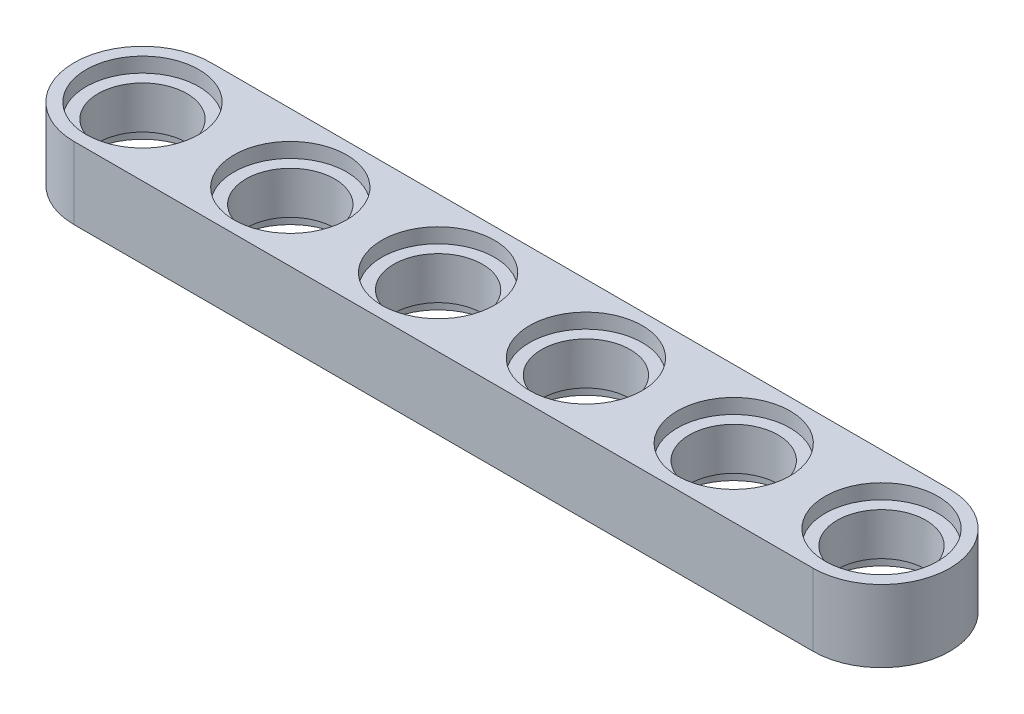
ISO-10303-21;
HEADER;
FILE_DESCRIPTION(('STEP AP214'),'2;1');
FILE_NAME('part.step','',(''),(''),'','','');
FILE_SCHEMA(('AUTOMOTIVE_DESIGN { 1 0 10303 214 1 1 1 1 }'));
ENDSEC;
DATA;
#1=APPLICATION_CONTEXT('core data for automotive mechanical design processes');
#2=APPLICATION_PROTOCOL_DEFINITION('international standard','automotive_design',2000,#1);
#3=PRODUCT_CONTEXT('',#1,'mechanical');
#4=PRODUCT('Part','Part','',(#3));
#5=PRODUCT_RELATED_PRODUCT_CATEGORY('part','',(#4));
#6=PRODUCT_DEFINITION_FORMATION('','',#4);
#7=PRODUCT_DEFINITION_CONTEXT('part definition',#1,'design');
#8=PRODUCT_DEFINITION('design','',#6,#7);
#9=PRODUCT_DEFINITION_SHAPE('','',#8);
#10=(LENGTH_UNIT() NAMED_UNIT(*) SI_UNIT(.MILLI.,.METRE.));
#11=(NAMED_UNIT(*) PLANE_ANGLE_UNIT() SI_UNIT($,.RADIAN.));
#12=(NAMED_UNIT(*) SI_UNIT($,.STERADIAN.) SOLID_ANGLE_UNIT());
#13=UNCERTAINTY_MEASURE_WITH_UNIT(LENGTH_MEASURE(1.E-05),#10,'distance_accuracy_value','');
#14=(GEOMETRIC_REPRESENTATION_CONTEXT(3) GLOBAL_UNCERTAINTY_ASSIGNED_CONTEXT((#13)) GLOBAL_UNIT_ASSIGNED_CONTEXT((#10,
#11,#12)) REPRESENTATION_CONTEXT('',''));
#15=CARTESIAN_POINT('',(0.,0.,0.));
#16=DIRECTION('',(0.,0.,1.));
#17=DIRECTION('',(1.,0.,0.));
#18=AXIS2_PLACEMENT_3D('',#15,#16,#17);
#19=CARTESIAN_POINT('',(0.,-3.9,0.));
#20=DIRECTION('',(0.,1.,0.));
#21=DIRECTION('',(0.,0.,1.));
#22=AXIS2_PLACEMENT_3D('',#19,#20,#21);
#23=CYLINDRICAL_SURFACE('',#22,2.4);
#24=CARTESIAN_POINT('',(0.,3.1,0.));
#25=DIRECTION('',(0.,1.,0.));
#26=DIRECTION('',(0.,0.,1.));
#27=AXIS2_PLACEMENT_3D('',#24,#25,#26);
#28=CIRCLE('',#27,2.4);
#29=CARTESIAN_POINT('',(0.,3.1,2.4));
#30=VERTEX_POINT('',#29);
#31=EDGE_CURVE('E109',#30,#30,#28,.F.);
#32=ORIENTED_EDGE('',*,*,#31,.F.);
#33=EDGE_LOOP('',(#32));
#34=FACE_BOUND('',#33,.T.);
#35=CARTESIAN_POINT('',(0.,0.8,0.));
#36=DIRECTION('',(0.,-1.,0.));
#37=DIRECTION('',(0.,0.,-1.));
#38=AXIS2_PLACEMENT_3D('',#35,#36,#37);
#39=CIRCLE('',#38,2.4);
#40=CARTESIAN_POINT('',(0.,0.8,-2.4));
#41=VERTEX_POINT('',#40);
#42=EDGE_CURVE('E40',#41,#41,#39,.F.);
#43=ORIENTED_EDGE('',*,*,#42,.F.);
#44=EDGE_LOOP('',(#43));
#45=FACE_BOUND('',#44,.T.);
#46=ADVANCED_FACE('F36',(#34,#45),#23,.F.);
#47=CARTESIAN_POINT('',(8.,-3.9,0.));
#48=DIRECTION('',(0.,1.,0.));
#49=DIRECTION('',(0.,0.,1.));
#50=AXIS2_PLACEMENT_3D('',#47,#48,#49);
#51=CYLINDRICAL_SURFACE('',#50,2.4);
#52=CARTESIAN_POINT('',(8.,3.1,0.));
#53=DIRECTION('',(0.,1.,0.));
#54=DIRECTION('',(0.,0.,1.));
#55=AXIS2_PLACEMENT_3D('',#52,#53,#54);
#56=CIRCLE('',#55,2.4);
#57=CARTESIAN_POINT('',(8.,3.1,2.4));
#58=VERTEX_POINT('',#57);
#59=EDGE_CURVE('E125',#58,#58,#56,.F.);
#60=ORIENTED_EDGE('',*,*,#59,.F.);
#61=EDGE_LOOP('',(#60));
#62=FACE_BOUND('',#61,.T.);
#63=CARTESIAN_POINT('',(8.,0.8,0.));
#64=DIRECTION('',(0.,-1.,0.));
#65=DIRECTION('',(0.,0.,-1.));
#66=AXIS2_PLACEMENT_3D('',#63,#64,#65);
#67=CIRCLE('',#66,2.4);
#68=CARTESIAN_POINT('',(8.,0.8,-2.4));
#69=VERTEX_POINT('',#68);
#70=EDGE_CURVE('E145',#69,#69,#67,.F.);
#71=ORIENTED_EDGE('',*,*,#70,.F.);
#72=EDGE_LOOP('',(#71));
#73=FACE_BOUND('',#72,.T.);
#74=ADVANCED_FACE('F227',(#62,#73),#51,.F.);
#75=CARTESIAN_POINT('',(-16.,-3.9,0.));
#76=DIRECTION('',(0.,1.,0.));
#77=DIRECTION('',(0.,0.,1.));
#78=AXIS2_PLACEMENT_3D('',#75,#76,#77);
#79=CYLINDRICAL_SURFACE('',#78,2.4);
#80=CARTESIAN_POINT('',(-16.,3.1,0.));
#81=DIRECTION('',(0.,1.,0.));
#82=DIRECTION('',(0.,0.,1.));
#83=AXIS2_PLACEMENT_3D('',#80,#81,#82);
#84=CIRCLE('',#83,2.4);
#85=CARTESIAN_POINT('',(-16.,3.1,2.4));
#86=VERTEX_POINT('',#85);
#87=EDGE_CURVE('E118',#86,#86,#84,.F.);
#88=ORIENTED_EDGE('',*,*,#87,.F.);
#89=EDGE_LOOP('',(#88));
#90=FACE_BOUND('',#89,.T.);
#91=CARTESIAN_POINT('',(-16.,0.8,0.));
#92=DIRECTION('',(0.,-1.,0.));
#93=DIRECTION('',(0.,0.,-1.));
#94=AXIS2_PLACEMENT_3D('',#91,#92,#93);
#95=CIRCLE('',#94,2.4);
#96=CARTESIAN_POINT('',(-16.,0.8,-2.4));
#97=VERTEX_POINT('',#96);
#98=EDGE_CURVE('E143',#97,#97,#95,.F.);
#99=ORIENTED_EDGE('',*,*,#98,.F.);
#100=EDGE_LOOP('',(#99));
#101=FACE_BOUND('',#100,.T.);
#102=ADVANCED_FACE('F233',(#90,#101),#79,.F.);
#103=CARTESIAN_POINT('',(24.,-3.9,0.));
#104=DIRECTION('',(0.,1.,0.));
#105=DIRECTION('',(0.,0.,1.));
#106=AXIS2_PLACEMENT_3D('',#103,#104,#105);
#107=CYLINDRICAL_SURFACE('',#106,2.4);
#108=CARTESIAN_POINT('',(24.,3.1,0.));
#109=DIRECTION('',(0.,1.,0.));
#110=DIRECTION('',(0.,0.,1.));
#111=AXIS2_PLACEMENT_3D('',#108,#109,#110);
#112=CIRCLE('',#111,2.4);
#113=CARTESIAN_POINT('',(24.,3.1,2.4));
#114=VERTEX_POINT('',#113);
#115=EDGE_CURVE('E115',#114,#114,#112,.F.);
#116=ORIENTED_EDGE('',*,*,#115,.F.);
#117=EDGE_LOOP('',(#116));
#118=FACE_BOUND('',#117,.T.);
#119=CARTESIAN_POINT('',(24.,0.8,0.));
#120=DIRECTION('',(0.,-1.,0.));
#121=DIRECTION('',(0.,0.,-1.));
#122=AXIS2_PLACEMENT_3D('',#119,#120,#121);
#123=CIRCLE('',#122,2.4);
#124=CARTESIAN_POINT('',(24.,0.8,-2.4));
#125=VERTEX_POINT('',#124);
#126=EDGE_CURVE('E140',#125,#125,#123,.F.);
#127=ORIENTED_EDGE('',*,*,#126,.F.);
#128=EDGE_LOOP('',(#127));
#129=FACE_BOUND('',#128,.T.);
#130=ADVANCED_FACE('F383',(#118,#129),#107,.F.);
#131=CARTESIAN_POINT('',(-16.,3.9,-3.7));
#132=DIRECTION('',(0.,0.,-1.));
#133=DIRECTION('',(-1.,0.,0.));
#134=AXIS2_PLACEMENT_3D('',#131,#132,#133);
#135=PLANE('',#134);
#136=DIRECTION('',(1.,0.,0.));
#137=VECTOR('',#136,1.);
#138=CARTESIAN_POINT('',(-16.,0.,-3.7));
#139=LINE('',#138,#137);
#140=CARTESIAN_POINT('',(-16.,0.,-3.7));
#141=VERTEX_POINT('',#140);
#142=CARTESIAN_POINT('',(24.,0.,-3.7));
#143=VERTEX_POINT('',#142);
#144=EDGE_CURVE('E105',#141,#143,#139,.T.);
#145=ORIENTED_EDGE('',*,*,#144,.F.);
#146=DIRECTION('',(0.,-1.,0.));
#147=VECTOR('',#146,1.);
#148=CARTESIAN_POINT('',(-16.,3.9,-3.7));
#149=LINE('',#148,#147);
#150=CARTESIAN_POINT('',(-16.,3.9,-3.7));
#151=VERTEX_POINT('',#150);
#152=EDGE_CURVE('E11',#151,#141,#149,.T.);
#153=ORIENTED_EDGE('',*,*,#152,.F.);
#154=DIRECTION('',(1.,0.,0.));
#155=VECTOR('',#154,1.);
#156=CARTESIAN_POINT('',(-16.,3.9,-3.7));
#157=LINE('',#156,#155);
#158=CARTESIAN_POINT('',(24.,3.9,-3.7));
#159=VERTEX_POINT('',#158);
#160=EDGE_CURVE('E99',#151,#159,#157,.T.);
#161=ORIENTED_EDGE('',*,*,#160,.T.);
#162=DIRECTION('',(0.,-1.,0.));
#163=VECTOR('',#162,1.);
#164=CARTESIAN_POINT('',(24.,3.9,-3.7));
#165=LINE('',#164,#163);
#166=EDGE_CURVE('E78',#159,#143,#165,.T.);
#167=ORIENTED_EDGE('',*,*,#166,.T.);
#168=EDGE_LOOP('',(#145,#153,#161,#167));
#169=FACE_BOUND('',#168,.T.);
#170=ADVANCED_FACE('F38',(#169),#135,.T.);
#171=CARTESIAN_POINT('',(-16.,3.9,0.));
#172=DIRECTION('',(0.,-1.,0.));
#173=DIRECTION('',(0.,0.,-1.));
#174=AXIS2_PLACEMENT_3D('',#171,#172,#173);
#175=CYLINDRICAL_SURFACE('',#174,3.7);
#176=CARTESIAN_POINT('',(-16.,0.,0.));
#177=DIRECTION('',(0.,1.,0.));
#178=DIRECTION('',(0.,0.,1.));
#179=AXIS2_PLACEMENT_3D('',#176,#177,#178);
#180=CIRCLE('',#179,3.7);
#181=CARTESIAN_POINT('',(-16.,0.,3.7));
#182=VERTEX_POINT('',#181);
#183=EDGE_CURVE('E70',#141,#182,#180,.T.);
#184=ORIENTED_EDGE('',*,*,#183,.T.);
#185=DIRECTION('',(0.,-1.,0.));
#186=VECTOR('',#185,1.);
#187=CARTESIAN_POINT('',(-16.,3.9,3.7));
#188=LINE('',#187,#186);
#189=CARTESIAN_POINT('',(-16.,3.9,3.7));
#190=VERTEX_POINT('',#189);
#191=EDGE_CURVE('E46',#190,#182,#188,.T.);
#192=ORIENTED_EDGE('',*,*,#191,.F.);
#193=CARTESIAN_POINT('',(-16.,3.9,0.));
#194=DIRECTION('',(0.,1.,0.));
#195=DIRECTION('',(0.,0.,1.));
#196=AXIS2_PLACEMENT_3D('',#193,#194,#195);
#197=CIRCLE('',#196,3.7);
#198=EDGE_CURVE('E88',#151,#190,#197,.T.);
#199=ORIENTED_EDGE('',*,*,#198,.F.);
#200=ORIENTED_EDGE('',*,*,#152,.T.);
#201=EDGE_LOOP('',(#184,#192,#199,#200));
#202=FACE_BOUND('',#201,.T.);
#203=ADVANCED_FACE('F245',(#202),#175,.T.);
#204=CARTESIAN_POINT('',(-16.,3.9,3.7));
#205=DIRECTION('',(0.,0.,-1.));
#206=DIRECTION('',(-1.,0.,0.));
#207=AXIS2_PLACEMENT_3D('',#204,#205,#206);
#208=PLANE('',#207);
#209=DIRECTION('',(1.,0.,0.));
#210=VECTOR('',#209,1.);
#211=CARTESIAN_POINT('',(-16.,0.,3.7));
#212=LINE('',#211,#210);
#213=CARTESIAN_POINT('',(24.,0.,3.7));
#214=VERTEX_POINT('',#213);
#215=EDGE_CURVE('E95',#182,#214,#212,.T.);
#216=ORIENTED_EDGE('',*,*,#215,.T.);
#217=DIRECTION('',(0.,-1.,0.));
#218=VECTOR('',#217,1.);
#219=CARTESIAN_POINT('',(24.,3.9,3.7));
#220=LINE('',#219,#218);
#221=CARTESIAN_POINT('',(24.,3.9,3.7));
#222=VERTEX_POINT('',#221);
#223=EDGE_CURVE('E92',#222,#214,#220,.T.);
#224=ORIENTED_EDGE('',*,*,#223,.F.);
#225=DIRECTION('',(1.,0.,0.));
#226=VECTOR('',#225,1.);
#227=CARTESIAN_POINT('',(-16.,3.9,3.7));
#228=LINE('',#227,#226);
#229=EDGE_CURVE('E83',#190,#222,#228,.T.);
#230=ORIENTED_EDGE('',*,*,#229,.F.);
#231=ORIENTED_EDGE('',*,*,#191,.T.);
#232=EDGE_LOOP('',(#216,#224,#230,#231));
#233=FACE_BOUND('',#232,.T.);
#234=ADVANCED_FACE('F93',(#233),#208,.F.);
#235=CARTESIAN_POINT('',(24.,3.9,0.));
#236=DIRECTION('',(0.,-1.,0.));
#237=DIRECTION('',(0.,0.,-1.));
#238=AXIS2_PLACEMENT_3D('',#235,#236,#237);
#239=CYLINDRICAL_SURFACE('',#238,3.7);
#240=CARTESIAN_POINT('',(24.,0.,0.));
#241=DIRECTION('',(0.,-1.,0.));
#242=DIRECTION('',(0.,0.,-1.));
#243=AXIS2_PLACEMENT_3D('',#240,#241,#242);
#244=CIRCLE('',#243,3.7);
#245=EDGE_CURVE('E108',#143,#214,#244,.T.);
#246=ORIENTED_EDGE('',*,*,#245,.F.);
#247=ORIENTED_EDGE('',*,*,#166,.F.);
#248=CARTESIAN_POINT('',(24.,3.9,0.));
#249=DIRECTION('',(0.,-1.,0.));
#250=DIRECTION('',(0.,0.,-1.));
#251=AXIS2_PLACEMENT_3D('',#248,#249,#250);
#252=CIRCLE('',#251,3.7);
#253=EDGE_CURVE('E87',#159,#222,#252,.T.);
#254=ORIENTED_EDGE('',*,*,#253,.T.);
#255=ORIENTED_EDGE('',*,*,#223,.T.);
#256=EDGE_LOOP('',(#246,#247,#254,#255));
#257=FACE_BOUND('',#256,.T.);
#258=ADVANCED_FACE('F98',(#257),#239,.T.);
#259=CARTESIAN_POINT('',(24.,3.9,0.));
#260=DIRECTION('',(0.,-1.,0.));
#261=DIRECTION('',(0.,0.,-1.));
#262=AXIS2_PLACEMENT_3D('',#259,#260,#261);
#263=PLANE('',#262);
#264=CARTESIAN_POINT('',(24.,3.9,0.));
#265=DIRECTION('',(0.,1.,0.));
#266=DIRECTION('',(0.,0.,1.));
#267=AXIS2_PLACEMENT_3D('',#264,#265,#266);
#268=CIRCLE('',#267,3.05);
#269=CARTESIAN_POINT('',(24.,3.9,3.05));
#270=VERTEX_POINT('',#269);
#271=EDGE_CURVE('E150',#270,#270,#268,.T.);
#272=ORIENTED_EDGE('',*,*,#271,.F.);
#273=EDGE_LOOP('',(#272));
#274=FACE_BOUND('',#273,.T.);
#275=CARTESIAN_POINT('',(-8.,3.9,0.));
#276=DIRECTION('',(0.,1.,0.));
#277=DIRECTION('',(0.,0.,-1.));
#278=AXIS2_PLACEMENT_3D('',#275,#276,#277);
#279=CIRCLE('',#278,3.05);
#280=CARTESIAN_POINT('',(-8.,3.9,-3.05));
#281=VERTEX_POINT('',#280);
#282=EDGE_CURVE('E159',#281,#281,#279,.T.);
#283=ORIENTED_EDGE('',*,*,#282,.F.);
#284=EDGE_LOOP('',(#283));
#285=FACE_BOUND('',#284,.T.);
#286=CARTESIAN_POINT('',(-16.,3.9,0.));
#287=DIRECTION('',(0.,1.,0.));
#288=DIRECTION('',(0.,0.,1.));
#289=AXIS2_PLACEMENT_3D('',#286,#287,#288);
#290=CIRCLE('',#289,3.05);
#291=CARTESIAN_POINT('',(-16.,3.9,3.05));
#292=VERTEX_POINT('',#291);
#293=EDGE_CURVE('E189',#292,#292,#290,.T.);
#294=ORIENTED_EDGE('',*,*,#293,.F.);
#295=EDGE_LOOP('',(#294));
#296=FACE_BOUND('',#295,.T.);
#297=CARTESIAN_POINT('',(16.,3.9,0.));
#298=DIRECTION('',(0.,1.,0.));
#299=DIRECTION('',(0.,0.,-1.));
#300=AXIS2_PLACEMENT_3D('',#297,#298,#299);
#301=CIRCLE('',#300,3.05);
#302=CARTESIAN_POINT('',(16.,3.9,-3.05));
#303=VERTEX_POINT('',#302);
#304=EDGE_CURVE('E183',#303,#303,#301,.T.);
#305=ORIENTED_EDGE('',*,*,#304,.F.);
#306=EDGE_LOOP('',(#305));
#307=FACE_BOUND('',#306,.T.);
#308=CARTESIAN_POINT('',(0.,3.9,0.));
#309=DIRECTION('',(0.,1.,0.));
#310=DIRECTION('',(0.,0.,1.));
#311=AXIS2_PLACEMENT_3D('',#308,#309,#310);
#312=CIRCLE('',#311,3.05);
#313=CARTESIAN_POINT('',(0.,3.9,3.05));
#314=VERTEX_POINT('',#313);
#315=EDGE_CURVE('E170',#314,#314,#312,.T.);
#316=ORIENTED_EDGE('',*,*,#315,.F.);
#317=EDGE_LOOP('',(#316));
#318=FACE_BOUND('',#317,.T.);
#319=CARTESIAN_POINT('',(8.,3.9,0.));
#320=DIRECTION('',(0.,1.,0.));
#321=DIRECTION('',(0.,0.,1.));
#322=AXIS2_PLACEMENT_3D('',#319,#320,#321);
#323=CIRCLE('',#322,3.05);
#324=CARTESIAN_POINT('',(8.,3.9,3.05));
#325=VERTEX_POINT('',#324);
#326=EDGE_CURVE('E164',#325,#325,#323,.T.);
#327=ORIENTED_EDGE('',*,*,#326,.F.);
#328=EDGE_LOOP('',(#327));
#329=FACE_BOUND('',#328,.T.);
#330=ORIENTED_EDGE('',*,*,#160,.F.);
#331=ORIENTED_EDGE('',*,*,#198,.T.);
#332=ORIENTED_EDGE('',*,*,#229,.T.);
#333=ORIENTED_EDGE('',*,*,#253,.F.);
#334=EDGE_LOOP('',(#330,#331,#332,#333));
#335=FACE_BOUND('',#334,.T.);
#336=ADVANCED_FACE('F86',(#274,#285,#296,#307,#318,#329,#335),#263,.F.);
#337=CARTESIAN_POINT('',(24.,0.,0.));
#338=DIRECTION('',(0.,-1.,0.));
#339=DIRECTION('',(0.,0.,-1.));
#340=AXIS2_PLACEMENT_3D('',#337,#338,#339);
#341=PLANE('',#340);
#342=CARTESIAN_POINT('',(24.,0.,0.));
#343=DIRECTION('',(0.,-1.,0.));
#344=DIRECTION('',(0.,0.,-1.));
#345=AXIS2_PLACEMENT_3D('',#342,#343,#344);
#346=CIRCLE('',#345,3.05);
#347=CARTESIAN_POINT('',(24.,0.,-3.05));
#348=VERTEX_POINT('',#347);
#349=EDGE_CURVE('E516',#348,#348,#346,.T.);
#350=ORIENTED_EDGE('',*,*,#349,.F.);
#351=EDGE_LOOP('',(#350));
#352=FACE_BOUND('',#351,.T.);
#353=CARTESIAN_POINT('',(-8.,0.,0.));
#354=DIRECTION('',(0.,-1.,0.));
#355=DIRECTION('',(0.,0.,1.));
#356=AXIS2_PLACEMENT_3D('',#353,#354,#355);
#357=CIRCLE('',#356,3.05);
#358=CARTESIAN_POINT('',(-8.,0.,3.05));
#359=VERTEX_POINT('',#358);
#360=EDGE_CURVE('E511',#359,#359,#357,.T.);
#361=ORIENTED_EDGE('',*,*,#360,.F.);
#362=EDGE_LOOP('',(#361));
#363=FACE_BOUND('',#362,.T.);
#364=CARTESIAN_POINT('',(-16.,0.,0.));
#365=DIRECTION('',(0.,-1.,0.));
#366=DIRECTION('',(0.,0.,-1.));
#367=AXIS2_PLACEMENT_3D('',#364,#365,#366);
#368=CIRCLE('',#367,3.05);
#369=CARTESIAN_POINT('',(-16.,0.,-3.05));
#370=VERTEX_POINT('',#369);
#371=EDGE_CURVE('E505',#370,#370,#368,.T.);
#372=ORIENTED_EDGE('',*,*,#371,.F.);
#373=EDGE_LOOP('',(#372));
#374=FACE_BOUND('',#373,.T.);
#375=CARTESIAN_POINT('',(16.,0.,0.));
#376=DIRECTION('',(0.,-1.,0.));
#377=DIRECTION('',(0.,0.,1.));
#378=AXIS2_PLACEMENT_3D('',#375,#376,#377);
#379=CIRCLE('',#378,3.05);
#380=CARTESIAN_POINT('',(16.,0.,3.05));
#381=VERTEX_POINT('',#380);
#382=EDGE_CURVE('E499',#381,#381,#379,.T.);
#383=ORIENTED_EDGE('',*,*,#382,.F.);
#384=EDGE_LOOP('',(#383));
#385=FACE_BOUND('',#384,.T.);
#386=CARTESIAN_POINT('',(0.,0.,0.));
#387=DIRECTION('',(0.,-1.,0.));
#388=DIRECTION('',(0.,0.,-1.));
#389=AXIS2_PLACEMENT_3D('',#386,#387,#388);
#390=CIRCLE('',#389,3.05);
#391=CARTESIAN_POINT('',(0.,0.,-3.05));
#392=VERTEX_POINT('',#391);
#393=EDGE_CURVE('E490',#392,#392,#390,.T.);
#394=ORIENTED_EDGE('',*,*,#393,.F.);
#395=EDGE_LOOP('',(#394));
#396=FACE_BOUND('',#395,.T.);
#397=CARTESIAN_POINT('',(8.,0.,0.));
#398=DIRECTION('',(0.,-1.,0.));
#399=DIRECTION('',(0.,0.,-1.));
#400=AXIS2_PLACEMENT_3D('',#397,#398,#399);
#401=CIRCLE('',#400,3.05);
#402=CARTESIAN_POINT('',(8.,0.,-3.05));
#403=VERTEX_POINT('',#402);
#404=EDGE_CURVE('E178',#403,#403,#401,.T.);
#405=ORIENTED_EDGE('',*,*,#404,.F.);
#406=EDGE_LOOP('',(#405));
#407=FACE_BOUND('',#406,.T.);
#408=ORIENTED_EDGE('',*,*,#144,.T.);
#409=ORIENTED_EDGE('',*,*,#245,.T.);
#410=ORIENTED_EDGE('',*,*,#215,.F.);
#411=ORIENTED_EDGE('',*,*,#183,.F.);
#412=EDGE_LOOP('',(#408,#409,#410,#411));
#413=FACE_BOUND('',#412,.T.);
#414=ADVANCED_FACE('F201',(#352,#363,#374,#385,#396,#407,#413),#341,.T.);
#415=CARTESIAN_POINT('',(-8.,-3.9,0.));
#416=DIRECTION('',(0.,1.,0.));
#417=DIRECTION('',(0.,0.,1.));
#418=AXIS2_PLACEMENT_3D('',#415,#416,#417);
#419=CYLINDRICAL_SURFACE('',#418,2.4);
#420=CARTESIAN_POINT('',(-8.,0.8,0.));
#421=DIRECTION('',(0.,1.,0.));
#422=DIRECTION('',(0.,0.,1.));
#423=AXIS2_PLACEMENT_3D('',#420,#421,#422);
#424=CIRCLE('',#423,2.4);
#425=CARTESIAN_POINT('',(-8.,0.8,2.4));
#426=VERTEX_POINT('',#425);
#427=EDGE_CURVE('E136',#426,#426,#424,.F.);
#428=ORIENTED_EDGE('',*,*,#427,.T.);
#429=EDGE_LOOP('',(#428));
#430=FACE_BOUND('',#429,.T.);
#431=CARTESIAN_POINT('',(-8.,3.1,0.));
#432=DIRECTION('',(0.,-1.,0.));
#433=DIRECTION('',(0.,0.,-1.));
#434=AXIS2_PLACEMENT_3D('',#431,#432,#433);
#435=CIRCLE('',#434,2.4);
#436=CARTESIAN_POINT('',(-8.,3.1,-2.4));
#437=VERTEX_POINT('',#436);
#438=EDGE_CURVE('E128',#437,#437,#435,.F.);
#439=ORIENTED_EDGE('',*,*,#438,.T.);
#440=EDGE_LOOP('',(#439));
#441=FACE_BOUND('',#440,.T.);
#442=ADVANCED_FACE('F243',(#430,#441),#419,.F.);
#443=CARTESIAN_POINT('',(16.,-3.9,0.));
#444=DIRECTION('',(0.,1.,0.));
#445=DIRECTION('',(0.,0.,1.));
#446=AXIS2_PLACEMENT_3D('',#443,#444,#445);
#447=CYLINDRICAL_SURFACE('',#446,2.4);
#448=CARTESIAN_POINT('',(16.,0.8,0.));
#449=DIRECTION('',(0.,1.,0.));
#450=DIRECTION('',(0.,0.,1.));
#451=AXIS2_PLACEMENT_3D('',#448,#449,#450);
#452=CIRCLE('',#451,2.4);
#453=CARTESIAN_POINT('',(16.,0.8,2.4));
#454=VERTEX_POINT('',#453);
#455=EDGE_CURVE('E133',#454,#454,#452,.F.);
#456=ORIENTED_EDGE('',*,*,#455,.T.);
#457=EDGE_LOOP('',(#456));
#458=FACE_BOUND('',#457,.T.);
#459=CARTESIAN_POINT('',(16.,3.1,0.));
#460=DIRECTION('',(0.,-1.,0.));
#461=DIRECTION('',(0.,0.,-1.));
#462=AXIS2_PLACEMENT_3D('',#459,#460,#461);
#463=CIRCLE('',#462,2.4);
#464=CARTESIAN_POINT('',(16.,3.1,-2.4));
#465=VERTEX_POINT('',#464);
#466=EDGE_CURVE('E122',#465,#465,#463,.F.);
#467=ORIENTED_EDGE('',*,*,#466,.T.);
#468=EDGE_LOOP('',(#467));
#469=FACE_BOUND('',#468,.T.);
#470=ADVANCED_FACE('F239',(#458,#469),#447,.F.);
#471=CARTESIAN_POINT('',(24.,3.1,0.));
#472=DIRECTION('',(0.,1.,0.));
#473=DIRECTION('',(0.,0.,1.));
#474=AXIS2_PLACEMENT_3D('',#471,#472,#473);
#475=PLANE('',#474);
#476=CARTESIAN_POINT('',(24.,3.1,0.));
#477=DIRECTION('',(0.,1.,0.));
#478=DIRECTION('',(0.,0.,1.));
#479=AXIS2_PLACEMENT_3D('',#476,#477,#478);
#480=CIRCLE('',#479,3.05);
#481=CARTESIAN_POINT('',(24.,3.1,3.05));
#482=VERTEX_POINT('',#481);
#483=EDGE_CURVE('E154',#482,#482,#480,.T.);
#484=ORIENTED_EDGE('',*,*,#483,.T.);
#485=EDGE_LOOP('',(#484));
#486=FACE_BOUND('',#485,.T.);
#487=ORIENTED_EDGE('',*,*,#115,.T.);
#488=EDGE_LOOP('',(#487));
#489=FACE_BOUND('',#488,.T.);
#490=ADVANCED_FACE('F277',(#486,#489),#475,.T.);
#491=CARTESIAN_POINT('',(24.,3.1,0.));
#492=DIRECTION('',(0.,1.,0.));
#493=DIRECTION('',(0.,0.,1.));
#494=AXIS2_PLACEMENT_3D('',#491,#492,#493);
#495=CYLINDRICAL_SURFACE('',#494,3.05);
#496=ORIENTED_EDGE('',*,*,#483,.F.);
#497=EDGE_LOOP('',(#496));
#498=FACE_BOUND('',#497,.T.);
#499=ORIENTED_EDGE('',*,*,#271,.T.);
#500=EDGE_LOOP('',(#499));
#501=FACE_BOUND('',#500,.T.);
#502=ADVANCED_FACE('F284',(#498,#501),#495,.F.);
#503=CARTESIAN_POINT('',(-16.,3.1,0.));
#504=DIRECTION('',(0.,1.,0.));
#505=DIRECTION('',(0.,0.,1.));
#506=AXIS2_PLACEMENT_3D('',#503,#504,#505);
#507=PLANE('',#506);
#508=CARTESIAN_POINT('',(-16.,3.1,0.));
#509=DIRECTION('',(0.,1.,0.));
#510=DIRECTION('',(0.,0.,1.));
#511=AXIS2_PLACEMENT_3D('',#508,#509,#510);
#512=CIRCLE('',#511,3.05);
#513=CARTESIAN_POINT('',(-16.,3.1,3.05));
#514=VERTEX_POINT('',#513);
#515=EDGE_CURVE('E186',#514,#514,#512,.T.);
#516=ORIENTED_EDGE('',*,*,#515,.T.);
#517=EDGE_LOOP('',(#516));
#518=FACE_BOUND('',#517,.T.);
#519=ORIENTED_EDGE('',*,*,#87,.T.);
#520=EDGE_LOOP('',(#519));
#521=FACE_BOUND('',#520,.T.);
#522=ADVANCED_FACE('F292',(#518,#521),#507,.T.);
#523=CARTESIAN_POINT('',(-16.,3.1,0.));
#524=DIRECTION('',(0.,1.,0.));
#525=DIRECTION('',(0.,0.,1.));
#526=AXIS2_PLACEMENT_3D('',#523,#524,#525);
#527=CYLINDRICAL_SURFACE('',#526,3.05);
#528=ORIENTED_EDGE('',*,*,#515,.F.);
#529=EDGE_LOOP('',(#528));
#530=FACE_BOUND('',#529,.T.);
#531=ORIENTED_EDGE('',*,*,#293,.T.);
#532=EDGE_LOOP('',(#531));
#533=FACE_BOUND('',#532,.T.);
#534=ADVANCED_FACE('F300',(#530,#533),#527,.F.);
#535=CARTESIAN_POINT('',(16.,3.1,0.));
#536=DIRECTION('',(0.,-1.,0.));
#537=DIRECTION('',(0.,0.,-1.));
#538=AXIS2_PLACEMENT_3D('',#535,#536,#537);
#539=PLANE('',#538);
#540=CARTESIAN_POINT('',(16.,3.1,0.));
#541=DIRECTION('',(0.,1.,0.));
#542=DIRECTION('',(0.,0.,-1.));
#543=AXIS2_PLACEMENT_3D('',#540,#541,#542);
#544=CIRCLE('',#543,3.05);
#545=CARTESIAN_POINT('',(16.,3.1,-3.05));
#546=VERTEX_POINT('',#545);
#547=EDGE_CURVE('E175',#546,#546,#544,.T.);
#548=ORIENTED_EDGE('',*,*,#547,.T.);
#549=EDGE_LOOP('',(#548));
#550=FACE_BOUND('',#549,.T.);
#551=ORIENTED_EDGE('',*,*,#466,.F.);
#552=EDGE_LOOP('',(#551));
#553=FACE_BOUND('',#552,.T.);
#554=ADVANCED_FACE('F308',(#550,#553),#539,.F.);
#555=CARTESIAN_POINT('',(16.,3.1,0.));
#556=DIRECTION('',(0.,1.,0.));
#557=DIRECTION('',(0.,0.,1.));
#558=AXIS2_PLACEMENT_3D('',#555,#556,#557);
#559=CYLINDRICAL_SURFACE('',#558,3.05);
#560=ORIENTED_EDGE('',*,*,#547,.F.);
#561=EDGE_LOOP('',(#560));
#562=FACE_BOUND('',#561,.T.);
#563=ORIENTED_EDGE('',*,*,#304,.T.);
#564=EDGE_LOOP('',(#563));
#565=FACE_BOUND('',#564,.T.);
#566=ADVANCED_FACE('F316',(#562,#565),#559,.F.);
#567=CARTESIAN_POINT('',(8.,3.1,0.));
#568=DIRECTION('',(0.,1.,0.));
#569=DIRECTION('',(0.,0.,1.));
#570=AXIS2_PLACEMENT_3D('',#567,#568,#569);
#571=PLANE('',#570);
#572=CARTESIAN_POINT('',(8.,3.1,0.));
#573=DIRECTION('',(0.,1.,0.));
#574=DIRECTION('',(0.,0.,1.));
#575=AXIS2_PLACEMENT_3D('',#572,#573,#574);
#576=CIRCLE('',#575,3.05);
#577=CARTESIAN_POINT('',(8.,3.1,3.05));
#578=VERTEX_POINT('',#577);
#579=EDGE_CURVE('E119',#578,#578,#576,.T.);
#580=ORIENTED_EDGE('',*,*,#579,.T.);
#581=EDGE_LOOP('',(#580));
#582=FACE_BOUND('',#581,.T.);
#583=ORIENTED_EDGE('',*,*,#59,.T.);
#584=EDGE_LOOP('',(#583));
#585=FACE_BOUND('',#584,.T.);
#586=ADVANCED_FACE('F323',(#582,#585),#571,.T.);
#587=CARTESIAN_POINT('',(8.,3.1,0.));
#588=DIRECTION('',(0.,1.,0.));
#589=DIRECTION('',(0.,0.,1.));
#590=AXIS2_PLACEMENT_3D('',#587,#588,#589);
#591=CYLINDRICAL_SURFACE('',#590,3.05);
#592=ORIENTED_EDGE('',*,*,#579,.F.);
#593=EDGE_LOOP('',(#592));
#594=FACE_BOUND('',#593,.T.);
#595=ORIENTED_EDGE('',*,*,#326,.T.);
#596=EDGE_LOOP('',(#595));
#597=FACE_BOUND('',#596,.T.);
#598=ADVANCED_FACE('F331',(#594,#597),#591,.F.);
#599=CARTESIAN_POINT('',(-8.,3.1,0.));
#600=DIRECTION('',(0.,-1.,0.));
#601=DIRECTION('',(0.,0.,-1.));
#602=AXIS2_PLACEMENT_3D('',#599,#600,#601);
#603=PLANE('',#602);
#604=CARTESIAN_POINT('',(-8.,3.1,0.));
#605=DIRECTION('',(0.,1.,0.));
#606=DIRECTION('',(0.,0.,-1.));
#607=AXIS2_PLACEMENT_3D('',#604,#605,#606);
#608=CIRCLE('',#607,3.05);
#609=CARTESIAN_POINT('',(-8.,3.1,-3.05));
#610=VERTEX_POINT('',#609);
#611=EDGE_CURVE('E192',#610,#610,#608,.T.);
#612=ORIENTED_EDGE('',*,*,#611,.T.);
#613=EDGE_LOOP('',(#612));
#614=FACE_BOUND('',#613,.T.);
#615=ORIENTED_EDGE('',*,*,#438,.F.);
#616=EDGE_LOOP('',(#615));
#617=FACE_BOUND('',#616,.T.);
#618=ADVANCED_FACE('F339',(#614,#617),#603,.F.);
#619=CARTESIAN_POINT('',(-8.,3.1,0.));
#620=DIRECTION('',(0.,1.,0.));
#621=DIRECTION('',(0.,0.,1.));
#622=AXIS2_PLACEMENT_3D('',#619,#620,#621);
#623=CYLINDRICAL_SURFACE('',#622,3.05);
#624=ORIENTED_EDGE('',*,*,#611,.F.);
#625=EDGE_LOOP('',(#624));
#626=FACE_BOUND('',#625,.T.);
#627=ORIENTED_EDGE('',*,*,#282,.T.);
#628=EDGE_LOOP('',(#627));
#629=FACE_BOUND('',#628,.T.);
#630=ADVANCED_FACE('F197',(#626,#629),#623,.F.);
#631=CARTESIAN_POINT('',(0.,3.1,0.));
#632=DIRECTION('',(0.,1.,0.));
#633=DIRECTION('',(0.,0.,1.));
#634=AXIS2_PLACEMENT_3D('',#631,#632,#633);
#635=PLANE('',#634);
#636=CARTESIAN_POINT('',(0.,3.1,0.));
#637=DIRECTION('',(0.,1.,0.));
#638=DIRECTION('',(0.,0.,1.));
#639=AXIS2_PLACEMENT_3D('',#636,#637,#638);
#640=CIRCLE('',#639,3.05);
#641=CARTESIAN_POINT('',(0.,3.1,3.05));
#642=VERTEX_POINT('',#641);
#643=EDGE_CURVE('E166',#642,#642,#640,.T.);
#644=ORIENTED_EDGE('',*,*,#643,.T.);
#645=EDGE_LOOP('',(#644));
#646=FACE_BOUND('',#645,.T.);
#647=ORIENTED_EDGE('',*,*,#31,.T.);
#648=EDGE_LOOP('',(#647));
#649=FACE_BOUND('',#648,.T.);
#650=ADVANCED_FACE('F214',(#646,#649),#635,.T.);
#651=CARTESIAN_POINT('',(0.,3.1,0.));
#652=DIRECTION('',(0.,1.,0.));
#653=DIRECTION('',(0.,0.,1.));
#654=AXIS2_PLACEMENT_3D('',#651,#652,#653);
#655=CYLINDRICAL_SURFACE('',#654,3.05);
#656=ORIENTED_EDGE('',*,*,#643,.F.);
#657=EDGE_LOOP('',(#656));
#658=FACE_BOUND('',#657,.T.);
#659=ORIENTED_EDGE('',*,*,#315,.T.);
#660=EDGE_LOOP('',(#659));
#661=FACE_BOUND('',#660,.T.);
#662=ADVANCED_FACE('F211',(#658,#661),#655,.F.);
#663=CARTESIAN_POINT('',(16.,0.8,0.));
#664=DIRECTION('',(0.,1.,0.));
#665=DIRECTION('',(0.,0.,1.));
#666=AXIS2_PLACEMENT_3D('',#663,#664,#665);
#667=PLANE('',#666);
#668=CARTESIAN_POINT('',(16.,0.8,0.));
#669=DIRECTION('',(0.,-1.,0.));
#670=DIRECTION('',(0.,0.,1.));
#671=AXIS2_PLACEMENT_3D('',#668,#669,#670);
#672=CIRCLE('',#671,3.05);
#673=CARTESIAN_POINT('',(16.,0.8,3.05));
#674=VERTEX_POINT('',#673);
#675=EDGE_CURVE('E494',#674,#674,#672,.T.);
#676=ORIENTED_EDGE('',*,*,#675,.T.);
#677=EDGE_LOOP('',(#676));
#678=FACE_BOUND('',#677,.T.);
#679=ORIENTED_EDGE('',*,*,#455,.F.);
#680=EDGE_LOOP('',(#679));
#681=FACE_BOUND('',#680,.T.);
#682=ADVANCED_FACE('F213',(#678,#681),#667,.F.);
#683=CARTESIAN_POINT('',(16.,0.8,0.));
#684=DIRECTION('',(0.,-1.,0.));
#685=DIRECTION('',(0.,0.,-1.));
#686=AXIS2_PLACEMENT_3D('',#683,#684,#685);
#687=CYLINDRICAL_SURFACE('',#686,3.05);
#688=ORIENTED_EDGE('',*,*,#675,.F.);
#689=EDGE_LOOP('',(#688));
#690=FACE_BOUND('',#689,.T.);
#691=ORIENTED_EDGE('',*,*,#382,.T.);
#692=EDGE_LOOP('',(#691));
#693=FACE_BOUND('',#692,.T.);
#694=ADVANCED_FACE('F221',(#690,#693),#687,.F.);
#695=CARTESIAN_POINT('',(-8.,0.8,0.));
#696=DIRECTION('',(0.,1.,0.));
#697=DIRECTION('',(0.,0.,1.));
#698=AXIS2_PLACEMENT_3D('',#695,#696,#697);
#699=PLANE('',#698);
#700=CARTESIAN_POINT('',(-8.,0.8,0.));
#701=DIRECTION('',(0.,-1.,0.));
#702=DIRECTION('',(0.,0.,1.));
#703=AXIS2_PLACEMENT_3D('',#700,#701,#702);
#704=CIRCLE('',#703,3.05);
#705=CARTESIAN_POINT('',(-8.,0.8,3.05));
#706=VERTEX_POINT('',#705);
#707=EDGE_CURVE('E508',#706,#706,#704,.T.);
#708=ORIENTED_EDGE('',*,*,#707,.T.);
#709=EDGE_LOOP('',(#708));
#710=FACE_BOUND('',#709,.T.);
#711=ORIENTED_EDGE('',*,*,#427,.F.);
#712=EDGE_LOOP('',(#711));
#713=FACE_BOUND('',#712,.T.);
#714=ADVANCED_FACE('F539',(#710,#713),#699,.F.);
#715=CARTESIAN_POINT('',(-8.,0.8,0.));
#716=DIRECTION('',(0.,-1.,0.));
#717=DIRECTION('',(0.,0.,-1.));
#718=AXIS2_PLACEMENT_3D('',#715,#716,#717);
#719=CYLINDRICAL_SURFACE('',#718,3.05);
#720=ORIENTED_EDGE('',*,*,#707,.F.);
#721=EDGE_LOOP('',(#720));
#722=FACE_BOUND('',#721,.T.);
#723=ORIENTED_EDGE('',*,*,#360,.T.);
#724=EDGE_LOOP('',(#723));
#725=FACE_BOUND('',#724,.T.);
#726=ADVANCED_FACE('F465',(#722,#725),#719,.F.);
#727=CARTESIAN_POINT('',(8.,0.8,0.));
#728=DIRECTION('',(0.,-1.,0.));
#729=DIRECTION('',(0.,0.,-1.));
#730=AXIS2_PLACEMENT_3D('',#727,#728,#729);
#731=PLANE('',#730);
#732=CARTESIAN_POINT('',(8.,0.8,0.));
#733=DIRECTION('',(0.,-1.,0.));
#734=DIRECTION('',(0.,0.,-1.));
#735=AXIS2_PLACEMENT_3D('',#732,#733,#734);
#736=CIRCLE('',#735,3.05);
#737=CARTESIAN_POINT('',(8.,0.8,-3.05));
#738=VERTEX_POINT('',#737);
#739=EDGE_CURVE('E137',#738,#738,#736,.T.);
#740=ORIENTED_EDGE('',*,*,#739,.T.);
#741=EDGE_LOOP('',(#740));
#742=FACE_BOUND('',#741,.T.);
#743=ORIENTED_EDGE('',*,*,#70,.T.);
#744=EDGE_LOOP('',(#743));
#745=FACE_BOUND('',#744,.T.);
#746=ADVANCED_FACE('F468',(#742,#745),#731,.T.);
#747=CARTESIAN_POINT('',(8.,0.8,0.));
#748=DIRECTION('',(0.,-1.,0.));
#749=DIRECTION('',(0.,0.,-1.));
#750=AXIS2_PLACEMENT_3D('',#747,#748,#749);
#751=CYLINDRICAL_SURFACE('',#750,3.05);
#752=ORIENTED_EDGE('',*,*,#739,.F.);
#753=EDGE_LOOP('',(#752));
#754=FACE_BOUND('',#753,.T.);
#755=ORIENTED_EDGE('',*,*,#404,.T.);
#756=EDGE_LOOP('',(#755));
#757=FACE_BOUND('',#756,.T.);
#758=ADVANCED_FACE('F471',(#754,#757),#751,.F.);
#759=CARTESIAN_POINT('',(0.,0.8,0.));
#760=DIRECTION('',(0.,-1.,0.));
#761=DIRECTION('',(0.,0.,-1.));
#762=AXIS2_PLACEMENT_3D('',#759,#760,#761);
#763=PLANE('',#762);
#764=CARTESIAN_POINT('',(0.,0.8,0.));
#765=DIRECTION('',(0.,-1.,0.));
#766=DIRECTION('',(0.,0.,-1.));
#767=AXIS2_PLACEMENT_3D('',#764,#765,#766);
#768=CIRCLE('',#767,3.05);
#769=CARTESIAN_POINT('',(0.,0.8,-3.05));
#770=VERTEX_POINT('',#769);
#771=EDGE_CURVE('E488',#770,#770,#768,.T.);
#772=ORIENTED_EDGE('',*,*,#771,.T.);
#773=EDGE_LOOP('',(#772));
#774=FACE_BOUND('',#773,.T.);
#775=ORIENTED_EDGE('',*,*,#42,.T.);
#776=EDGE_LOOP('',(#775));
#777=FACE_BOUND('',#776,.T.);
#778=ADVANCED_FACE('F474',(#774,#777),#763,.T.);
#779=CARTESIAN_POINT('',(0.,0.8,0.));
#780=DIRECTION('',(0.,-1.,0.));
#781=DIRECTION('',(0.,0.,-1.));
#782=AXIS2_PLACEMENT_3D('',#779,#780,#781);
#783=CYLINDRICAL_SURFACE('',#782,3.05);
#784=ORIENTED_EDGE('',*,*,#771,.F.);
#785=EDGE_LOOP('',(#784));
#786=FACE_BOUND('',#785,.T.);
#787=ORIENTED_EDGE('',*,*,#393,.T.);
#788=EDGE_LOOP('',(#787));
#789=FACE_BOUND('',#788,.T.);
#790=ADVANCED_FACE('F479',(#786,#789),#783,.F.);
#791=CARTESIAN_POINT('',(-16.,0.8,0.));
#792=DIRECTION('',(0.,-1.,0.));
#793=DIRECTION('',(0.,0.,-1.));
#794=AXIS2_PLACEMENT_3D('',#791,#792,#793);
#795=PLANE('',#794);
#796=CARTESIAN_POINT('',(-16.,0.8,0.));
#797=DIRECTION('',(0.,-1.,0.));
#798=DIRECTION('',(0.,0.,-1.));
#799=AXIS2_PLACEMENT_3D('',#796,#797,#798);
#800=CIRCLE('',#799,3.05);
#801=CARTESIAN_POINT('',(-16.,0.8,-3.05));
#802=VERTEX_POINT('',#801);
#803=EDGE_CURVE('E502',#802,#802,#800,.T.);
#804=ORIENTED_EDGE('',*,*,#803,.T.);
#805=EDGE_LOOP('',(#804));
#806=FACE_BOUND('',#805,.T.);
#807=ORIENTED_EDGE('',*,*,#98,.T.);
#808=EDGE_LOOP('',(#807));
#809=FACE_BOUND('',#808,.T.);
#810=ADVANCED_FACE('F460',(#806,#809),#795,.T.);
#811=CARTESIAN_POINT('',(-16.,0.8,0.));
#812=DIRECTION('',(0.,-1.,0.));
#813=DIRECTION('',(0.,0.,-1.));
#814=AXIS2_PLACEMENT_3D('',#811,#812,#813);
#815=CYLINDRICAL_SURFACE('',#814,3.05);
#816=ORIENTED_EDGE('',*,*,#803,.F.);
#817=EDGE_LOOP('',(#816));
#818=FACE_BOUND('',#817,.T.);
#819=ORIENTED_EDGE('',*,*,#371,.T.);
#820=EDGE_LOOP('',(#819));
#821=FACE_BOUND('',#820,.T.);
#822=ADVANCED_FACE('F451',(#818,#821),#815,.F.);
#823=CARTESIAN_POINT('',(24.,0.8,0.));
#824=DIRECTION('',(0.,-1.,0.));
#825=DIRECTION('',(0.,0.,-1.));
#826=AXIS2_PLACEMENT_3D('',#823,#824,#825);
#827=PLANE('',#826);
#828=CARTESIAN_POINT('',(24.,0.8,0.));
#829=DIRECTION('',(0.,-1.,0.));
#830=DIRECTION('',(0.,0.,-1.));
#831=AXIS2_PLACEMENT_3D('',#828,#829,#830);
#832=CIRCLE('',#831,3.05);
#833=CARTESIAN_POINT('',(24.,0.8,-3.05));
#834=VERTEX_POINT('',#833);
#835=EDGE_CURVE('E514',#834,#834,#832,.T.);
#836=ORIENTED_EDGE('',*,*,#835,.T.);
#837=EDGE_LOOP('',(#836));
#838=FACE_BOUND('',#837,.T.);
#839=ORIENTED_EDGE('',*,*,#126,.T.);
#840=EDGE_LOOP('',(#839));
#841=FACE_BOUND('',#840,.T.);
#842=ADVANCED_FACE('F448',(#838,#841),#827,.T.);
#843=CARTESIAN_POINT('',(24.,0.8,0.));
#844=DIRECTION('',(0.,-1.,0.));
#845=DIRECTION('',(0.,0.,-1.));
#846=AXIS2_PLACEMENT_3D('',#843,#844,#845);
#847=CYLINDRICAL_SURFACE('',#846,3.05);
#848=ORIENTED_EDGE('',*,*,#835,.F.);
#849=EDGE_LOOP('',(#848));
#850=FACE_BOUND('',#849,.T.);
#851=ORIENTED_EDGE('',*,*,#349,.T.);
#852=EDGE_LOOP('',(#851));
#853=FACE_BOUND('',#852,.T.);
#854=ADVANCED_FACE('F450',(#850,#853),#847,.F.);
#855=CLOSED_SHELL('',(#46,#74,#102,#130,#170,#203,#234,#258,#336,#414,#442,#470,#490,#502,#522,
#534,#554,#566,#586,#598,#618,#630,#650,#662,#682,#694,#714,#726,#746,#758,#778,#790,#810,#822,
#842,#854));
#856=MANIFOLD_SOLID_BREP('B2',#855);
#857=ADVANCED_BREP_SHAPE_REPRESENTATION('',(#18,#856),#14);
#858=SHAPE_DEFINITION_REPRESENTATION(#9,#857);
ENDSEC;
END-ISO-10303-21;
